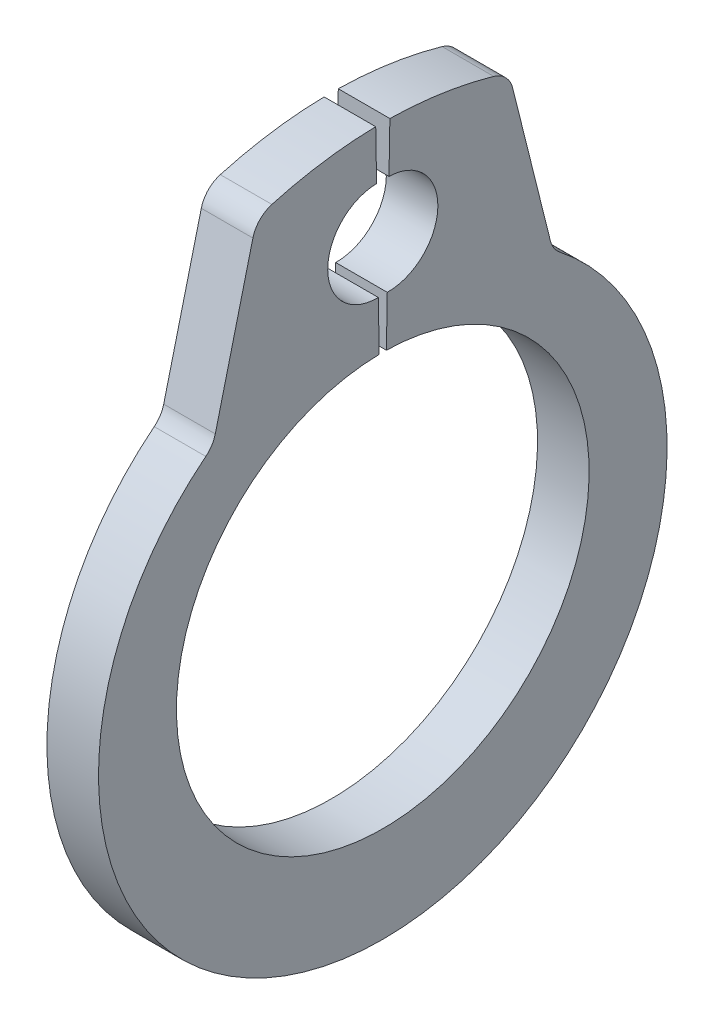
ISO-10303-21;
HEADER;
FILE_DESCRIPTION(('STEP AP214'),'2;1');
FILE_NAME('part.step','',(''),(''),'','','');
FILE_SCHEMA(('AUTOMOTIVE_DESIGN { 1 0 10303 214 1 1 1 1 }'));
ENDSEC;
DATA;
#1=APPLICATION_CONTEXT('core data for automotive mechanical design processes');
#2=APPLICATION_PROTOCOL_DEFINITION('international standard','automotive_design',2000,#1);
#3=PRODUCT_CONTEXT('',#1,'mechanical');
#4=PRODUCT('Part','Part','',(#3));
#5=PRODUCT_RELATED_PRODUCT_CATEGORY('part','',(#4));
#6=PRODUCT_DEFINITION_FORMATION('','',#4);
#7=PRODUCT_DEFINITION_CONTEXT('part definition',#1,'design');
#8=PRODUCT_DEFINITION('design','',#6,#7);
#9=PRODUCT_DEFINITION_SHAPE('','',#8);
#10=(LENGTH_UNIT() NAMED_UNIT(*) SI_UNIT(.MILLI.,.METRE.));
#11=(NAMED_UNIT(*) PLANE_ANGLE_UNIT() SI_UNIT($,.RADIAN.));
#12=(NAMED_UNIT(*) SI_UNIT($,.STERADIAN.) SOLID_ANGLE_UNIT());
#13=UNCERTAINTY_MEASURE_WITH_UNIT(LENGTH_MEASURE(1.E-05),#10,'distance_accuracy_value','');
#14=(GEOMETRIC_REPRESENTATION_CONTEXT(3) GLOBAL_UNCERTAINTY_ASSIGNED_CONTEXT((#13)) GLOBAL_UNIT_ASSIGNED_CONTEXT((#10,
#11,#12)) REPRESENTATION_CONTEXT('',''));
#15=CARTESIAN_POINT('',(0.,0.,0.));
#16=DIRECTION('',(0.,0.,1.));
#17=DIRECTION('',(1.,0.,0.));
#18=AXIS2_PLACEMENT_3D('',#15,#16,#17);
#19=CARTESIAN_POINT('',(0.35,0.,0.));
#20=DIRECTION('',(-1.,0.,0.));
#21=DIRECTION('',(0.,0.,1.));
#22=AXIS2_PLACEMENT_3D('',#19,#20,#21);
#23=CYLINDRICAL_SURFACE('',#22,2.8);
#24=CARTESIAN_POINT('',(-0.35,0.,0.));
#25=DIRECTION('',(-1.,0.,0.));
#26=DIRECTION('',(0.,0.,-1.));
#27=AXIS2_PLACEMENT_3D('',#24,#25,#26);
#28=CIRCLE('',#27,2.8);
#29=CARTESIAN_POINT('',(-0.35,2.7995735464379,-0.0488667380243939));
#30=VERTEX_POINT('',#29);
#31=CARTESIAN_POINT('',(-0.35,2.7995735464379,0.0488667380243939));
#32=VERTEX_POINT('',#31);
#33=EDGE_CURVE('E199',#30,#32,#28,.T.);
#34=ORIENTED_EDGE('',*,*,#33,.T.);
#35=DIRECTION('',(-1.,0.,0.));
#36=VECTOR('',#35,1.);
#37=CARTESIAN_POINT('',(0.35,2.7995735464379,0.0488667380243939));
#38=LINE('',#37,#36);
#39=CARTESIAN_POINT('',(0.35,2.7995735464379,0.0488667380243939));
#40=VERTEX_POINT('',#39);
#41=EDGE_CURVE('E178',#40,#32,#38,.T.);
#42=ORIENTED_EDGE('',*,*,#41,.F.);
#43=CARTESIAN_POINT('',(0.35,0.,0.));
#44=DIRECTION('',(-1.,0.,0.));
#45=DIRECTION('',(0.,0.,-1.));
#46=AXIS2_PLACEMENT_3D('',#43,#44,#45);
#47=CIRCLE('',#46,2.8);
#48=CARTESIAN_POINT('',(0.35,2.7995735464379,-0.0488667380243939));
#49=VERTEX_POINT('',#48);
#50=EDGE_CURVE('E185',#49,#40,#47,.T.);
#51=ORIENTED_EDGE('',*,*,#50,.F.);
#52=DIRECTION('',(-1.,0.,0.));
#53=VECTOR('',#52,1.);
#54=CARTESIAN_POINT('',(0.35,2.7995735464379,-0.0488667380243939));
#55=LINE('',#54,#53);
#56=EDGE_CURVE('E296',#49,#30,#55,.T.);
#57=ORIENTED_EDGE('',*,*,#56,.T.);
#58=EDGE_LOOP('',(#34,#42,#51,#57));
#59=FACE_BOUND('',#58,.T.);
#60=ADVANCED_FACE('F17',(#59),#23,.F.);
#61=CARTESIAN_POINT('',(0.35,3.47447074066846,0.0606471123695604));
#62=DIRECTION('',(0.,-0.0174524064372836,0.999847695156391));
#63=DIRECTION('',(0.,-0.999847695156391,-0.0174524064372836));
#64=AXIS2_PLACEMENT_3D('',#61,#62,#63);
#65=PLANE('',#64);
#66=DIRECTION('',(0.,0.999847695156391,0.0174524064372836));
#67=VECTOR('',#66,1.);
#68=CARTESIAN_POINT('',(-0.35,3.47447074066846,0.0606471123695604));
#69=LINE('',#68,#67);
#70=CARTESIAN_POINT('',(-0.35,3.47447074066846,0.0606471123695604));
#71=VERTEX_POINT('',#70);
#72=EDGE_CURVE('E299',#32,#71,#69,.T.);
#73=ORIENTED_EDGE('',*,*,#72,.T.);
#74=DIRECTION('',(-1.,0.,0.));
#75=VECTOR('',#74,1.);
#76=CARTESIAN_POINT('',(0.35,3.47447074066846,0.0606471123695604));
#77=LINE('',#76,#75);
#78=CARTESIAN_POINT('',(0.35,3.47447074066846,0.0606471123695604));
#79=VERTEX_POINT('',#78);
#80=EDGE_CURVE('E181',#79,#71,#77,.T.);
#81=ORIENTED_EDGE('',*,*,#80,.F.);
#82=DIRECTION('',(0.,0.999847695156391,0.0174524064372836));
#83=VECTOR('',#82,1.);
#84=CARTESIAN_POINT('',(0.35,3.47447074066846,0.0606471123695604));
#85=LINE('',#84,#83);
#86=EDGE_CURVE('E174',#40,#79,#85,.T.);
#87=ORIENTED_EDGE('',*,*,#86,.F.);
#88=ORIENTED_EDGE('',*,*,#41,.T.);
#89=EDGE_LOOP('',(#73,#81,#87,#88));
#90=FACE_BOUND('',#89,.T.);
#91=ADVANCED_FACE('F176',(#90),#65,.F.);
#92=CARTESIAN_POINT('',(0.35,4.14936793489902,0.0724274867147267));
#93=DIRECTION('',(-1.,0.,0.));
#94=DIRECTION('',(0.,0.,1.));
#95=AXIS2_PLACEMENT_3D('',#92,#93,#94);
#96=CYLINDRICAL_SURFACE('',#95,0.675);
#97=CARTESIAN_POINT('',(-0.35,4.14936793489902,0.0724274867147267));
#98=DIRECTION('',(-1.,0.,0.));
#99=DIRECTION('',(0.,0.,1.));
#100=AXIS2_PLACEMENT_3D('',#97,#98,#99);
#101=CIRCLE('',#100,0.675);
#102=CARTESIAN_POINT('',(-0.35,4.82426512912959,0.084207861059893));
#103=VERTEX_POINT('',#102);
#104=EDGE_CURVE('E302',#71,#103,#101,.T.);
#105=ORIENTED_EDGE('',*,*,#104,.T.);
#106=DIRECTION('',(-1.,0.,0.));
#107=VECTOR('',#106,1.);
#108=CARTESIAN_POINT('',(0.35,4.82426512912959,0.084207861059893));
#109=LINE('',#108,#107);
#110=CARTESIAN_POINT('',(0.35,4.82426512912959,0.084207861059893));
#111=VERTEX_POINT('',#110);
#112=EDGE_CURVE('E210',#111,#103,#109,.T.);
#113=ORIENTED_EDGE('',*,*,#112,.F.);
#114=CARTESIAN_POINT('',(0.35,4.14936793489902,0.0724274867147267));
#115=DIRECTION('',(-1.,0.,0.));
#116=DIRECTION('',(0.,0.,1.));
#117=AXIS2_PLACEMENT_3D('',#114,#115,#116);
#118=CIRCLE('',#117,0.675);
#119=EDGE_CURVE('E184',#79,#111,#118,.T.);
#120=ORIENTED_EDGE('',*,*,#119,.F.);
#121=ORIENTED_EDGE('',*,*,#80,.T.);
#122=EDGE_LOOP('',(#105,#113,#120,#121));
#123=FACE_BOUND('',#122,.T.);
#124=ADVANCED_FACE('F385',(#123),#96,.F.);
#125=CARTESIAN_POINT('',(0.35,4.82426512912959,0.0842078610598931));
#126=DIRECTION('',(0.,-0.0174524064372836,0.999847695156391));
#127=DIRECTION('',(0.,-0.999847695156391,-0.0174524064372836));
#128=AXIS2_PLACEMENT_3D('',#125,#126,#127);
#129=PLANE('',#128);
#130=DIRECTION('',(0.,0.999847695156391,0.0174524064372836));
#131=VECTOR('',#130,1.);
#132=CARTESIAN_POINT('',(-0.35,4.82426512912959,0.0842078610598931));
#133=LINE('',#132,#131);
#134=CARTESIAN_POINT('',(-0.35,5.49916232336015,0.0959882354050595));
#135=VERTEX_POINT('',#134);
#136=EDGE_CURVE('E305',#103,#135,#133,.T.);
#137=ORIENTED_EDGE('',*,*,#136,.T.);
#138=DIRECTION('',(-1.,0.,0.));
#139=VECTOR('',#138,1.);
#140=CARTESIAN_POINT('',(0.35,5.49916232336015,0.0959882354050595));
#141=LINE('',#140,#139);
#142=CARTESIAN_POINT('',(0.35,5.49916232336015,0.0959882354050595));
#143=VERTEX_POINT('',#142);
#144=EDGE_CURVE('E342',#143,#135,#141,.T.);
#145=ORIENTED_EDGE('',*,*,#144,.F.);
#146=DIRECTION('',(0.,0.999847695156391,0.0174524064372836));
#147=VECTOR('',#146,1.);
#148=CARTESIAN_POINT('',(0.35,4.82426512912959,0.0842078610598931));
#149=LINE('',#148,#147);
#150=EDGE_CURVE('E355',#111,#143,#149,.T.);
#151=ORIENTED_EDGE('',*,*,#150,.F.);
#152=ORIENTED_EDGE('',*,*,#112,.T.);
#153=EDGE_LOOP('',(#137,#145,#151,#152));
#154=FACE_BOUND('',#153,.T.);
#155=ADVANCED_FACE('F353',(#154),#129,.F.);
#156=CARTESIAN_POINT('',(0.35,0.,0.));
#157=DIRECTION('',(-1.,0.,0.));
#158=DIRECTION('',(0.,0.,1.));
#159=AXIS2_PLACEMENT_3D('',#156,#157,#158);
#160=CYLINDRICAL_SURFACE('',#159,5.5);
#161=CARTESIAN_POINT('',(-0.35,0.,0.));
#162=DIRECTION('',(1.,0.,0.));
#163=DIRECTION('',(0.,0.,-1.));
#164=AXIS2_PLACEMENT_3D('',#161,#162,#163);
#165=CIRCLE('',#164,5.5);
#166=CARTESIAN_POINT('',(-0.35,5.29007973590386,1.50501042779753));
#167=VERTEX_POINT('',#166);
#168=EDGE_CURVE('E308',#135,#167,#165,.T.);
#169=ORIENTED_EDGE('',*,*,#168,.T.);
#170=DIRECTION('',(-1.,0.,0.));
#171=VECTOR('',#170,1.);
#172=CARTESIAN_POINT('',(0.35,5.29007973590386,1.50501042779753));
#173=LINE('',#172,#171);
#174=CARTESIAN_POINT('',(0.35,5.29007973590386,1.50501042779753));
#175=VERTEX_POINT('',#174);
#176=EDGE_CURVE('E230',#167,#175,#173,.F.);
#177=ORIENTED_EDGE('',*,*,#176,.T.);
#178=CARTESIAN_POINT('',(0.35,0.,0.));
#179=DIRECTION('',(1.,0.,0.));
#180=DIRECTION('',(0.,0.,-1.));
#181=AXIS2_PLACEMENT_3D('',#178,#179,#180);
#182=CIRCLE('',#181,5.5);
#183=EDGE_CURVE('E370',#143,#175,#182,.T.);
#184=ORIENTED_EDGE('',*,*,#183,.F.);
#185=ORIENTED_EDGE('',*,*,#144,.T.);
#186=EDGE_LOOP('',(#169,#177,#184,#185));
#187=FACE_BOUND('',#186,.T.);
#188=ADVANCED_FACE('F361',(#187),#160,.T.);
#189=CARTESIAN_POINT('',(0.35,5.22671083370411,1.71216058266743));
#190=DIRECTION('',(0.,-0.241921895599665,-0.970295726275997));
#191=DIRECTION('',(0.,0.970295726275997,-0.241921895599665));
#192=AXIS2_PLACEMENT_3D('',#189,#190,#191);
#193=PLANE('',#192);
#194=DIRECTION('',(0.,-0.970295726275997,0.241921895599665));
#195=VECTOR('',#194,1.);
#196=CARTESIAN_POINT('',(-0.35,5.22671083370411,1.71216058266743));
#197=LINE('',#196,#195);
#198=CARTESIAN_POINT('',(-0.35,5.0237127459513,1.76277369046782));
#199=VERTEX_POINT('',#198);
#200=CARTESIAN_POINT('',(-0.35,2.97721193722231,2.27302364992516));
#201=VERTEX_POINT('',#200);
#202=EDGE_CURVE('E273',#199,#201,#197,.T.);
#203=ORIENTED_EDGE('',*,*,#202,.T.);
#204=DIRECTION('',(1.,0.,0.));
#205=VECTOR('',#204,1.);
#206=CARTESIAN_POINT('',(0.35,2.97721193722231,2.27302364992516));
#207=LINE('',#206,#205);
#208=CARTESIAN_POINT('',(0.35,2.97721193722231,2.27302364992516));
#209=VERTEX_POINT('',#208);
#210=EDGE_CURVE('E221',#201,#209,#207,.T.);
#211=ORIENTED_EDGE('',*,*,#210,.T.);
#212=DIRECTION('',(0.,-0.970295726275997,0.241921895599665));
#213=VECTOR('',#212,1.);
#214=CARTESIAN_POINT('',(0.35,5.22671083370411,1.71216058266743));
#215=LINE('',#214,#213);
#216=CARTESIAN_POINT('',(0.35,5.0237127459513,1.76277369046782));
#217=VERTEX_POINT('',#216);
#218=EDGE_CURVE('E286',#217,#209,#215,.T.);
#219=ORIENTED_EDGE('',*,*,#218,.F.);
#220=DIRECTION('',(-1.,0.,0.));
#221=VECTOR('',#220,1.);
#222=CARTESIAN_POINT('',(0.35,5.0237127459513,1.76277369046782));
#223=LINE('',#222,#221);
#224=EDGE_CURVE('E217',#217,#199,#223,.T.);
#225=ORIENTED_EDGE('',*,*,#224,.T.);
#226=EDGE_LOOP('',(#203,#211,#219,#225));
#227=FACE_BOUND('',#226,.T.);
#228=ADVANCED_FACE('F372',(#227),#193,.F.);
#229=CARTESIAN_POINT('',(0.35,-0.242048945637212,0.));
#230=DIRECTION('',(-1.,0.,0.));
#231=DIRECTION('',(0.,0.,1.));
#232=AXIS2_PLACEMENT_3D('',#229,#230,#231);
#233=CYLINDRICAL_SURFACE('',#232,3.85795105436279);
#234=CARTESIAN_POINT('',(0.35,-0.242048945637212,0.));
#235=DIRECTION('',(1.,0.,0.));
#236=DIRECTION('',(0.,0.,-1.));
#237=AXIS2_PLACEMENT_3D('',#234,#235,#236);
#238=CIRCLE('',#237,3.85795105436279);
#239=CARTESIAN_POINT('',(0.35,2.77716300858809,2.40169638241848));
#240=VERTEX_POINT('',#239);
#241=CARTESIAN_POINT('',(0.35,2.77716300858808,-2.40169638241849));
#242=VERTEX_POINT('',#241);
#243=EDGE_CURVE('E277',#240,#242,#238,.T.);
#244=ORIENTED_EDGE('',*,*,#243,.F.);
#245=DIRECTION('',(-1.,0.,0.));
#246=VECTOR('',#245,1.);
#247=CARTESIAN_POINT('',(0.35,2.77716300858809,2.40169638241848));
#248=LINE('',#247,#246);
#249=CARTESIAN_POINT('',(-0.35,2.77716300858809,2.40169638241848));
#250=VERTEX_POINT('',#249);
#251=EDGE_CURVE('E208',#240,#250,#248,.T.);
#252=ORIENTED_EDGE('',*,*,#251,.T.);
#253=CARTESIAN_POINT('',(-0.35,-0.242048945637212,0.));
#254=DIRECTION('',(1.,0.,0.));
#255=DIRECTION('',(0.,0.,-1.));
#256=AXIS2_PLACEMENT_3D('',#253,#254,#255);
#257=CIRCLE('',#256,3.85795105436279);
#258=CARTESIAN_POINT('',(-0.35,2.77716300858808,-2.40169638241849));
#259=VERTEX_POINT('',#258);
#260=EDGE_CURVE('E262',#250,#259,#257,.T.);
#261=ORIENTED_EDGE('',*,*,#260,.T.);
#262=DIRECTION('',(-1.,0.,0.));
#263=VECTOR('',#262,1.);
#264=CARTESIAN_POINT('',(0.35,2.77716300858808,-2.40169638241849));
#265=LINE('',#264,#263);
#266=EDGE_CURVE('E201',#259,#242,#265,.F.);
#267=ORIENTED_EDGE('',*,*,#266,.T.);
#268=EDGE_LOOP('',(#244,#252,#261,#267));
#269=FACE_BOUND('',#268,.T.);
#270=ADVANCED_FACE('F269',(#269),#233,.T.);
#271=CARTESIAN_POINT('',(0.35,5.22671083370411,-1.71216058266743));
#272=DIRECTION('',(0.,-0.241921895599667,0.970295726275997));
#273=DIRECTION('',(0.,-0.970295726275997,-0.241921895599667));
#274=AXIS2_PLACEMENT_3D('',#271,#272,#273);
#275=PLANE('',#274);
#276=DIRECTION('',(0.,0.970295726275997,0.241921895599667));
#277=VECTOR('',#276,1.);
#278=CARTESIAN_POINT('',(-0.35,5.22671083370411,-1.71216058266743));
#279=LINE('',#278,#277);
#280=CARTESIAN_POINT('',(-0.35,2.97721193722231,-2.27302364992517));
#281=VERTEX_POINT('',#280);
#282=CARTESIAN_POINT('',(-0.35,5.02371274595129,-1.76277369046782));
#283=VERTEX_POINT('',#282);
#284=EDGE_CURVE('E263',#281,#283,#279,.T.);
#285=ORIENTED_EDGE('',*,*,#284,.T.);
#286=DIRECTION('',(-1.,0.,0.));
#287=VECTOR('',#286,1.);
#288=CARTESIAN_POINT('',(0.35,5.02371274595129,-1.76277369046782));
#289=LINE('',#288,#287);
#290=CARTESIAN_POINT('',(0.35,5.02371274595129,-1.76277369046782));
#291=VERTEX_POINT('',#290);
#292=EDGE_CURVE('E50',#283,#291,#289,.F.);
#293=ORIENTED_EDGE('',*,*,#292,.T.);
#294=DIRECTION('',(0.,0.970295726275997,0.241921895599667));
#295=VECTOR('',#294,1.);
#296=CARTESIAN_POINT('',(0.35,5.22671083370411,-1.71216058266743));
#297=LINE('',#296,#295);
#298=CARTESIAN_POINT('',(0.35,2.97721193722231,-2.27302364992517));
#299=VERTEX_POINT('',#298);
#300=EDGE_CURVE('E276',#299,#291,#297,.T.);
#301=ORIENTED_EDGE('',*,*,#300,.F.);
#302=DIRECTION('',(1.,0.,0.));
#303=VECTOR('',#302,1.);
#304=CARTESIAN_POINT('',(-0.35,2.97721193722231,-2.27302364992517));
#305=LINE('',#304,#303);
#306=EDGE_CURVE('E242',#299,#281,#305,.F.);
#307=ORIENTED_EDGE('',*,*,#306,.T.);
#308=EDGE_LOOP('',(#285,#293,#301,#307));
#309=FACE_BOUND('',#308,.T.);
#310=ADVANCED_FACE('F278',(#309),#275,.F.);
#311=CARTESIAN_POINT('',(0.35,0.,0.));
#312=DIRECTION('',(-1.,0.,0.));
#313=DIRECTION('',(0.,0.,1.));
#314=AXIS2_PLACEMENT_3D('',#311,#312,#313);
#315=CYLINDRICAL_SURFACE('',#314,5.5);
#316=CARTESIAN_POINT('',(0.35,0.,0.));
#317=DIRECTION('',(1.,0.,0.));
#318=DIRECTION('',(0.,0.,1.));
#319=AXIS2_PLACEMENT_3D('',#316,#317,#318);
#320=CIRCLE('',#319,5.5);
#321=CARTESIAN_POINT('',(0.35,5.29007973590386,-1.50501042779753));
#322=VERTEX_POINT('',#321);
#323=CARTESIAN_POINT('',(0.35,5.49916232336015,-0.0959882354050614));
#324=VERTEX_POINT('',#323);
#325=EDGE_CURVE('E279',#322,#324,#320,.T.);
#326=ORIENTED_EDGE('',*,*,#325,.F.);
#327=DIRECTION('',(-1.,0.,0.));
#328=VECTOR('',#327,1.);
#329=CARTESIAN_POINT('',(0.35,5.29007973590386,-1.50501042779753));
#330=LINE('',#329,#328);
#331=CARTESIAN_POINT('',(-0.35,5.29007973590386,-1.50501042779753));
#332=VERTEX_POINT('',#331);
#333=EDGE_CURVE('E238',#322,#332,#330,.T.);
#334=ORIENTED_EDGE('',*,*,#333,.T.);
#335=CARTESIAN_POINT('',(-0.35,0.,0.));
#336=DIRECTION('',(1.,0.,0.));
#337=DIRECTION('',(0.,0.,1.));
#338=AXIS2_PLACEMENT_3D('',#335,#336,#337);
#339=CIRCLE('',#338,5.5);
#340=CARTESIAN_POINT('',(-0.35,5.49916232336015,-0.0959882354050614));
#341=VERTEX_POINT('',#340);
#342=EDGE_CURVE('E317',#332,#341,#339,.T.);
#343=ORIENTED_EDGE('',*,*,#342,.T.);
#344=DIRECTION('',(-1.,0.,0.));
#345=VECTOR('',#344,1.);
#346=CARTESIAN_POINT('',(0.35,5.49916232336015,-0.0959882354050614));
#347=LINE('',#346,#345);
#348=EDGE_CURVE('E338',#324,#341,#347,.T.);
#349=ORIENTED_EDGE('',*,*,#348,.F.);
#350=EDGE_LOOP('',(#326,#334,#343,#349));
#351=FACE_BOUND('',#350,.T.);
#352=ADVANCED_FACE('F414',(#351),#315,.T.);
#353=CARTESIAN_POINT('',(0.35,4.82426512912959,-0.0842078610598945));
#354=DIRECTION('',(0.,-0.0174524064372839,-0.999847695156391));
#355=DIRECTION('',(0.,0.999847695156391,-0.0174524064372839));
#356=AXIS2_PLACEMENT_3D('',#353,#354,#355);
#357=PLANE('',#356);
#358=DIRECTION('',(0.,-0.999847695156391,0.0174524064372839));
#359=VECTOR('',#358,1.);
#360=CARTESIAN_POINT('',(-0.35,4.82426512912959,-0.0842078610598945));
#361=LINE('',#360,#359);
#362=CARTESIAN_POINT('',(-0.35,4.82426512912959,-0.0842078610598945));
#363=VERTEX_POINT('',#362);
#364=EDGE_CURVE('E320',#341,#363,#361,.T.);
#365=ORIENTED_EDGE('',*,*,#364,.T.);
#366=DIRECTION('',(-1.,0.,0.));
#367=VECTOR('',#366,1.);
#368=CARTESIAN_POINT('',(0.35,4.82426512912959,-0.0842078610598945));
#369=LINE('',#368,#367);
#370=CARTESIAN_POINT('',(0.35,4.82426512912959,-0.0842078610598945));
#371=VERTEX_POINT('',#370);
#372=EDGE_CURVE('E334',#371,#363,#369,.T.);
#373=ORIENTED_EDGE('',*,*,#372,.F.);
#374=DIRECTION('',(0.,-0.999847695156391,0.0174524064372839));
#375=VECTOR('',#374,1.);
#376=CARTESIAN_POINT('',(0.35,4.82426512912959,-0.0842078610598945));
#377=LINE('',#376,#375);
#378=EDGE_CURVE('E283',#324,#371,#377,.T.);
#379=ORIENTED_EDGE('',*,*,#378,.F.);
#380=ORIENTED_EDGE('',*,*,#348,.T.);
#381=EDGE_LOOP('',(#365,#373,#379,#380));
#382=FACE_BOUND('',#381,.T.);
#383=ADVANCED_FACE('F421',(#382),#357,.F.);
#384=CARTESIAN_POINT('',(0.35,4.14936793489902,-0.0724274867147279));
#385=DIRECTION('',(-1.,0.,0.));
#386=DIRECTION('',(0.,0.,1.));
#387=AXIS2_PLACEMENT_3D('',#384,#385,#386);
#388=CYLINDRICAL_SURFACE('',#387,0.675);
#389=CARTESIAN_POINT('',(-0.35,4.14936793489902,-0.0724274867147279));
#390=DIRECTION('',(-1.,0.,0.));
#391=DIRECTION('',(0.,0.,1.));
#392=AXIS2_PLACEMENT_3D('',#389,#390,#391);
#393=CIRCLE('',#392,0.675);
#394=CARTESIAN_POINT('',(-0.35,3.47447074066845,-0.0606471123695612));
#395=VERTEX_POINT('',#394);
#396=EDGE_CURVE('E323',#363,#395,#393,.T.);
#397=ORIENTED_EDGE('',*,*,#396,.T.);
#398=DIRECTION('',(-1.,0.,0.));
#399=VECTOR('',#398,1.);
#400=CARTESIAN_POINT('',(0.35,3.47447074066845,-0.0606471123695612));
#401=LINE('',#400,#399);
#402=CARTESIAN_POINT('',(0.35,3.47447074066845,-0.0606471123695612));
#403=VERTEX_POINT('',#402);
#404=EDGE_CURVE('E330',#403,#395,#401,.T.);
#405=ORIENTED_EDGE('',*,*,#404,.F.);
#406=CARTESIAN_POINT('',(0.35,4.14936793489902,-0.0724274867147279));
#407=DIRECTION('',(-1.,0.,0.));
#408=DIRECTION('',(0.,0.,1.));
#409=AXIS2_PLACEMENT_3D('',#406,#407,#408);
#410=CIRCLE('',#409,0.675);
#411=EDGE_CURVE('E292',#371,#403,#410,.T.);
#412=ORIENTED_EDGE('',*,*,#411,.F.);
#413=ORIENTED_EDGE('',*,*,#372,.T.);
#414=EDGE_LOOP('',(#397,#405,#412,#413));
#415=FACE_BOUND('',#414,.T.);
#416=ADVANCED_FACE('F425',(#415),#388,.F.);
#417=CARTESIAN_POINT('',(0.35,2.7995735464379,-0.0488667380243939));
#418=DIRECTION('',(0.,-0.0174524064372851,-0.999847695156391));
#419=DIRECTION('',(0.,0.999847695156391,-0.0174524064372851));
#420=AXIS2_PLACEMENT_3D('',#417,#418,#419);
#421=PLANE('',#420);
#422=DIRECTION('',(0.,-0.999847695156391,0.0174524064372851));
#423=VECTOR('',#422,1.);
#424=CARTESIAN_POINT('',(-0.35,2.7995735464379,-0.0488667380243939));
#425=LINE('',#424,#423);
#426=EDGE_CURVE('E196',#395,#30,#425,.T.);
#427=ORIENTED_EDGE('',*,*,#426,.T.);
#428=ORIENTED_EDGE('',*,*,#56,.F.);
#429=DIRECTION('',(0.,-0.999847695156391,0.0174524064372851));
#430=VECTOR('',#429,1.);
#431=CARTESIAN_POINT('',(0.35,2.7995735464379,-0.0488667380243939));
#432=LINE('',#431,#430);
#433=EDGE_CURVE('E191',#403,#49,#432,.T.);
#434=ORIENTED_EDGE('',*,*,#433,.F.);
#435=ORIENTED_EDGE('',*,*,#404,.T.);
#436=EDGE_LOOP('',(#427,#428,#434,#435));
#437=FACE_BOUND('',#436,.T.);
#438=ADVANCED_FACE('F428',(#437),#421,.F.);
#439=CARTESIAN_POINT('',(0.35,0.,0.));
#440=DIRECTION('',(1.,0.,0.));
#441=DIRECTION('',(0.,0.,-1.));
#442=AXIS2_PLACEMENT_3D('',#439,#440,#441);
#443=PLANE('',#442);
#444=ORIENTED_EDGE('',*,*,#183,.T.);
#445=CARTESIAN_POINT('',(0.35,4.93420164457942,1.4037642717457));
#446=DIRECTION('',(1.,0.,0.));
#447=DIRECTION('',(0.,0.,-1.));
#448=AXIS2_PLACEMENT_3D('',#445,#446,#447);
#449=CIRCLE('',#448,0.37);
#450=EDGE_CURVE('E235',#175,#217,#449,.T.);
#451=ORIENTED_EDGE('',*,*,#450,.T.);
#452=ORIENTED_EDGE('',*,*,#218,.T.);
#453=CARTESIAN_POINT('',(0.35,3.06672303859418,2.63203306864728));
#454=DIRECTION('',(1.,0.,0.));
#455=DIRECTION('',(0.,0.,-1.));
#456=AXIS2_PLACEMENT_3D('',#453,#454,#455);
#457=CIRCLE('',#456,0.37);
#458=EDGE_CURVE('E251',#209,#240,#457,.F.);
#459=ORIENTED_EDGE('',*,*,#458,.T.);
#460=ORIENTED_EDGE('',*,*,#243,.T.);
#461=CARTESIAN_POINT('',(0.35,3.06672303859418,-2.63203306864729));
#462=DIRECTION('',(1.,0.,0.));
#463=DIRECTION('',(0.,0.,-1.));
#464=AXIS2_PLACEMENT_3D('',#461,#462,#463);
#465=CIRCLE('',#464,0.37);
#466=EDGE_CURVE('E11',#242,#299,#465,.F.);
#467=ORIENTED_EDGE('',*,*,#466,.T.);
#468=ORIENTED_EDGE('',*,*,#300,.T.);
#469=CARTESIAN_POINT('',(0.35,4.93420164457942,-1.4037642717457));
#470=DIRECTION('',(1.,0.,0.));
#471=DIRECTION('',(0.,0.,-1.));
#472=AXIS2_PLACEMENT_3D('',#469,#470,#471);
#473=CIRCLE('',#472,0.37);
#474=EDGE_CURVE('E39',#291,#322,#473,.T.);
#475=ORIENTED_EDGE('',*,*,#474,.T.);
#476=ORIENTED_EDGE('',*,*,#325,.T.);
#477=ORIENTED_EDGE('',*,*,#378,.T.);
#478=ORIENTED_EDGE('',*,*,#411,.T.);
#479=ORIENTED_EDGE('',*,*,#433,.T.);
#480=ORIENTED_EDGE('',*,*,#50,.T.);
#481=ORIENTED_EDGE('',*,*,#86,.T.);
#482=ORIENTED_EDGE('',*,*,#119,.T.);
#483=ORIENTED_EDGE('',*,*,#150,.T.);
#484=EDGE_LOOP('',(#444,#451,#452,#459,#460,#467,#468,#475,#476,#477,#478,#479,#480,#481,#482,#483));
#485=FACE_BOUND('',#484,.T.);
#486=ADVANCED_FACE('F189',(#485),#443,.T.);
#487=CARTESIAN_POINT('',(-0.35,0.,0.));
#488=DIRECTION('',(1.,0.,0.));
#489=DIRECTION('',(0.,0.,-1.));
#490=AXIS2_PLACEMENT_3D('',#487,#488,#489);
#491=PLANE('',#490);
#492=ORIENTED_EDGE('',*,*,#202,.F.);
#493=CARTESIAN_POINT('',(-0.35,4.93420164457942,1.4037642717457));
#494=DIRECTION('',(1.,0.,0.));
#495=DIRECTION('',(0.,0.,-1.));
#496=AXIS2_PLACEMENT_3D('',#493,#494,#495);
#497=CIRCLE('',#496,0.37);
#498=EDGE_CURVE('E227',#199,#167,#497,.F.);
#499=ORIENTED_EDGE('',*,*,#498,.T.);
#500=ORIENTED_EDGE('',*,*,#168,.F.);
#501=ORIENTED_EDGE('',*,*,#136,.F.);
#502=ORIENTED_EDGE('',*,*,#104,.F.);
#503=ORIENTED_EDGE('',*,*,#72,.F.);
#504=ORIENTED_EDGE('',*,*,#33,.F.);
#505=ORIENTED_EDGE('',*,*,#426,.F.);
#506=ORIENTED_EDGE('',*,*,#396,.F.);
#507=ORIENTED_EDGE('',*,*,#364,.F.);
#508=ORIENTED_EDGE('',*,*,#342,.F.);
#509=CARTESIAN_POINT('',(-0.35,4.93420164457942,-1.4037642717457));
#510=DIRECTION('',(1.,0.,0.));
#511=DIRECTION('',(0.,0.,-1.));
#512=AXIS2_PLACEMENT_3D('',#509,#510,#511);
#513=CIRCLE('',#512,0.37);
#514=EDGE_CURVE('E224',#332,#283,#513,.F.);
#515=ORIENTED_EDGE('',*,*,#514,.T.);
#516=ORIENTED_EDGE('',*,*,#284,.F.);
#517=CARTESIAN_POINT('',(-0.35,3.06672303859418,-2.63203306864729));
#518=DIRECTION('',(1.,0.,0.));
#519=DIRECTION('',(0.,0.,-1.));
#520=AXIS2_PLACEMENT_3D('',#517,#518,#519);
#521=CIRCLE('',#520,0.37);
#522=EDGE_CURVE('E26',#281,#259,#521,.T.);
#523=ORIENTED_EDGE('',*,*,#522,.T.);
#524=ORIENTED_EDGE('',*,*,#260,.F.);
#525=CARTESIAN_POINT('',(-0.35,3.06672303859418,2.63203306864728));
#526=DIRECTION('',(1.,0.,0.));
#527=DIRECTION('',(0.,0.,-1.));
#528=AXIS2_PLACEMENT_3D('',#525,#526,#527);
#529=CIRCLE('',#528,0.37);
#530=EDGE_CURVE('E248',#250,#201,#529,.T.);
#531=ORIENTED_EDGE('',*,*,#530,.T.);
#532=EDGE_LOOP('',(#492,#499,#500,#501,#502,#503,#504,#505,#506,#507,#508,#515,#516,#523,#524,#531));
#533=FACE_BOUND('',#532,.T.);
#534=ADVANCED_FACE('F261',(#533),#491,.F.);
#535=CARTESIAN_POINT('',(0.35,3.06672303859418,2.63203306864728));
#536=DIRECTION('',(-1.,0.,0.));
#537=DIRECTION('',(0.,0.,1.));
#538=AXIS2_PLACEMENT_3D('',#535,#536,#537);
#539=CYLINDRICAL_SURFACE('',#538,0.37);
#540=ORIENTED_EDGE('',*,*,#458,.F.);
#541=ORIENTED_EDGE('',*,*,#210,.F.);
#542=ORIENTED_EDGE('',*,*,#530,.F.);
#543=ORIENTED_EDGE('',*,*,#251,.F.);
#544=EDGE_LOOP('',(#540,#541,#542,#543));
#545=FACE_BOUND('',#544,.T.);
#546=ADVANCED_FACE('F400',(#545),#539,.F.);
#547=CARTESIAN_POINT('',(0.35,4.93420164457942,1.4037642717457));
#548=DIRECTION('',(-1.,0.,0.));
#549=DIRECTION('',(0.,0.,1.));
#550=AXIS2_PLACEMENT_3D('',#547,#548,#549);
#551=CYLINDRICAL_SURFACE('',#550,0.37);
#552=ORIENTED_EDGE('',*,*,#450,.F.);
#553=ORIENTED_EDGE('',*,*,#176,.F.);
#554=ORIENTED_EDGE('',*,*,#498,.F.);
#555=ORIENTED_EDGE('',*,*,#224,.F.);
#556=EDGE_LOOP('',(#552,#553,#554,#555));
#557=FACE_BOUND('',#556,.T.);
#558=ADVANCED_FACE('F365',(#557),#551,.T.);
#559=CARTESIAN_POINT('',(0.35,4.93420164457942,-1.4037642717457));
#560=DIRECTION('',(-1.,0.,0.));
#561=DIRECTION('',(0.,0.,1.));
#562=AXIS2_PLACEMENT_3D('',#559,#560,#561);
#563=CYLINDRICAL_SURFACE('',#562,0.37);
#564=ORIENTED_EDGE('',*,*,#474,.F.);
#565=ORIENTED_EDGE('',*,*,#292,.F.);
#566=ORIENTED_EDGE('',*,*,#514,.F.);
#567=ORIENTED_EDGE('',*,*,#333,.F.);
#568=EDGE_LOOP('',(#564,#565,#566,#567));
#569=FACE_BOUND('',#568,.T.);
#570=ADVANCED_FACE('F405',(#569),#563,.T.);
#571=CARTESIAN_POINT('',(0.35,3.06672303859418,-2.63203306864729));
#572=DIRECTION('',(-1.,0.,0.));
#573=DIRECTION('',(0.,0.,1.));
#574=AXIS2_PLACEMENT_3D('',#571,#572,#573);
#575=CYLINDRICAL_SURFACE('',#574,0.37);
#576=ORIENTED_EDGE('',*,*,#466,.F.);
#577=ORIENTED_EDGE('',*,*,#266,.F.);
#578=ORIENTED_EDGE('',*,*,#522,.F.);
#579=ORIENTED_EDGE('',*,*,#306,.F.);
#580=EDGE_LOOP('',(#576,#577,#578,#579));
#581=FACE_BOUND('',#580,.T.);
#582=ADVANCED_FACE('F19',(#581),#575,.F.);
#583=CLOSED_SHELL('',(#60,#91,#124,#155,#188,#228,#270,#310,#352,#383,#416,#438,#486,#534,#546,
#558,#570,#582));
#584=MANIFOLD_SOLID_BREP('B1',#583);
#585=ADVANCED_BREP_SHAPE_REPRESENTATION('',(#18,#584),#14);
#586=SHAPE_DEFINITION_REPRESENTATION(#9,#585);
ENDSEC;
END-ISO-10303-21;
